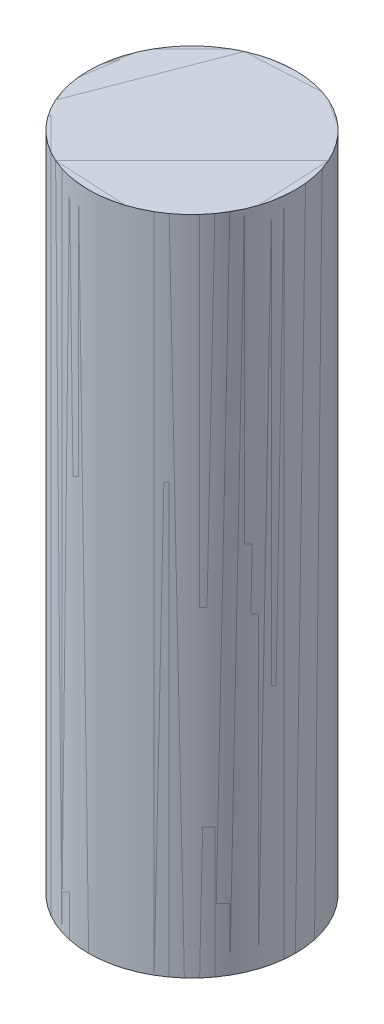
ISO-10303-21;
HEADER;
FILE_DESCRIPTION(('STEP AP214'),'2;1');
FILE_NAME('part.step','',(''),(''),'','','');
FILE_SCHEMA(('AUTOMOTIVE_DESIGN { 1 0 10303 214 1 1 1 1 }'));
ENDSEC;
DATA;
#1=APPLICATION_CONTEXT('core data for automotive mechanical design processes');
#2=APPLICATION_PROTOCOL_DEFINITION('international standard','automotive_design',2000,#1);
#3=PRODUCT_CONTEXT('',#1,'mechanical');
#4=PRODUCT('Part','Part','',(#3));
#5=PRODUCT_RELATED_PRODUCT_CATEGORY('part','',(#4));
#6=PRODUCT_DEFINITION_FORMATION('','',#4);
#7=PRODUCT_DEFINITION_CONTEXT('part definition',#1,'design');
#8=PRODUCT_DEFINITION('design','',#6,#7);
#9=PRODUCT_DEFINITION_SHAPE('','',#8);
#10=(LENGTH_UNIT() NAMED_UNIT(*) SI_UNIT(.MILLI.,.METRE.));
#11=(NAMED_UNIT(*) PLANE_ANGLE_UNIT() SI_UNIT($,.RADIAN.));
#12=(NAMED_UNIT(*) SI_UNIT($,.STERADIAN.) SOLID_ANGLE_UNIT());
#13=UNCERTAINTY_MEASURE_WITH_UNIT(LENGTH_MEASURE(1.E-05),#10,'distance_accuracy_value','');
#14=(GEOMETRIC_REPRESENTATION_CONTEXT(3) GLOBAL_UNCERTAINTY_ASSIGNED_CONTEXT((#13)) GLOBAL_UNIT_ASSIGNED_CONTEXT((#10,
#11,#12)) REPRESENTATION_CONTEXT('',''));
#15=CARTESIAN_POINT('',(0.,0.,0.));
#16=DIRECTION('',(0.,0.,1.));
#17=DIRECTION('',(1.,0.,0.));
#18=AXIS2_PLACEMENT_3D('',#15,#16,#17);
#19=CARTESIAN_POINT('',(0.,80.,0.));
#20=DIRECTION('',(0.,-1.,0.));
#21=DIRECTION('',(0.,0.,-1.));
#22=AXIS2_PLACEMENT_3D('',#19,#20,#21);
#23=CYLINDRICAL_SURFACE('',#22,12.5);
#24=CARTESIAN_POINT('',(0.,80.,0.));
#25=DIRECTION('',(0.,-1.,0.));
#26=DIRECTION('',(0.,0.,-1.));
#27=AXIS2_PLACEMENT_3D('',#24,#25,#26);
#28=CIRCLE('',#27,12.5);
#29=CARTESIAN_POINT('',(0.,80.,-12.5));
#30=VERTEX_POINT('',#29);
#31=EDGE_CURVE('E11',#30,#30,#28,.T.);
#32=ORIENTED_EDGE('',*,*,#31,.T.);
#33=EDGE_LOOP('',(#32));
#34=FACE_BOUND('',#33,.T.);
#35=CARTESIAN_POINT('',(0.,0.,0.));
#36=DIRECTION('',(0.,-1.,0.));
#37=DIRECTION('',(0.,0.,-1.));
#38=AXIS2_PLACEMENT_3D('',#35,#36,#37);
#39=CIRCLE('',#38,12.5);
#40=CARTESIAN_POINT('',(0.,0.,-12.5));
#41=VERTEX_POINT('',#40);
#42=EDGE_CURVE('E52',#41,#41,#39,.T.);
#43=ORIENTED_EDGE('',*,*,#42,.F.);
#44=EDGE_LOOP('',(#43));
#45=FACE_BOUND('',#44,.T.);
#46=ADVANCED_FACE('F49',(#34,#45),#23,.T.);
#47=CARTESIAN_POINT('',(0.,80.,0.));
#48=DIRECTION('',(0.,-1.,0.));
#49=DIRECTION('',(0.,0.,-1.));
#50=AXIS2_PLACEMENT_3D('',#47,#48,#49);
#51=PLANE('',#50);
#52=ORIENTED_EDGE('',*,*,#31,.F.);
#53=EDGE_LOOP('',(#52));
#54=FACE_BOUND('',#53,.T.);
#55=ADVANCED_FACE('F64',(#54),#51,.F.);
#56=CARTESIAN_POINT('',(0.,0.,0.));
#57=DIRECTION('',(0.,-1.,0.));
#58=DIRECTION('',(0.,0.,-1.));
#59=AXIS2_PLACEMENT_3D('',#56,#57,#58);
#60=PLANE('',#59);
#61=ORIENTED_EDGE('',*,*,#42,.T.);
#62=EDGE_LOOP('',(#61));
#63=FACE_BOUND('',#62,.T.);
#64=ADVANCED_FACE('F61',(#63),#60,.T.);
#65=CLOSED_SHELL('',(#46,#55,#64));
#66=MANIFOLD_SOLID_BREP('B2',#65);
#67=CARTESIAN_POINT('',(0.,80.,0.));
#68=DIRECTION('',(0.,-1.,0.));
#69=DIRECTION('',(0.,0.,-1.));
#70=AXIS2_PLACEMENT_3D('',#67,#68,#69);
#71=CYLINDRICAL_SURFACE('',#70,12.5);
#72=CARTESIAN_POINT('',(0.,80.,0.));
#73=DIRECTION('',(0.,1.,0.));
#74=DIRECTION('',(0.,0.,1.));
#75=AXIS2_PLACEMENT_3D('',#72,#73,#74);
#76=CIRCLE('',#75,12.5);
#77=CARTESIAN_POINT('',(0.,80.,12.5));
#78=VERTEX_POINT('',#77);
#79=EDGE_CURVE('E48',#78,#78,#76,.T.);
#80=ORIENTED_EDGE('',*,*,#79,.F.);
#81=EDGE_LOOP('',(#80));
#82=FACE_BOUND('',#81,.T.);
#83=CARTESIAN_POINT('',(0.,0.,0.));
#84=DIRECTION('',(0.,1.,0.));
#85=DIRECTION('',(0.,0.,1.));
#86=AXIS2_PLACEMENT_3D('',#83,#84,#85);
#87=CIRCLE('',#86,12.5);
#88=CARTESIAN_POINT('',(0.,0.,12.5));
#89=VERTEX_POINT('',#88);
#90=EDGE_CURVE('E93',#89,#89,#87,.T.);
#91=ORIENTED_EDGE('',*,*,#90,.T.);
#92=EDGE_LOOP('',(#91));
#93=FACE_BOUND('',#92,.T.);
#94=ADVANCED_FACE('F90',(#82,#93),#71,.T.);
#95=CARTESIAN_POINT('',(0.,80.,0.));
#96=DIRECTION('',(0.,1.,0.));
#97=DIRECTION('',(0.,0.,1.));
#98=AXIS2_PLACEMENT_3D('',#95,#96,#97);
#99=PLANE('',#98);
#100=ORIENTED_EDGE('',*,*,#79,.T.);
#101=EDGE_LOOP('',(#100));
#102=FACE_BOUND('',#101,.T.);
#103=ADVANCED_FACE('F107',(#102),#99,.T.);
#104=CARTESIAN_POINT('',(0.,0.,0.));
#105=DIRECTION('',(0.,1.,0.));
#106=DIRECTION('',(0.,0.,1.));
#107=AXIS2_PLACEMENT_3D('',#104,#105,#106);
#108=PLANE('',#107);
#109=ORIENTED_EDGE('',*,*,#90,.F.);
#110=EDGE_LOOP('',(#109));
#111=FACE_BOUND('',#110,.T.);
#112=ADVANCED_FACE('F105',(#111),#108,.F.);
#113=CLOSED_SHELL('',(#94,#103,#112));
#114=MANIFOLD_SOLID_BREP('B6',#113);
#115=ADVANCED_BREP_SHAPE_REPRESENTATION('',(#18,#66,#114),#14);
#116=SHAPE_DEFINITION_REPRESENTATION(#9,#115);
ENDSEC;
END-ISO-10303-21;
